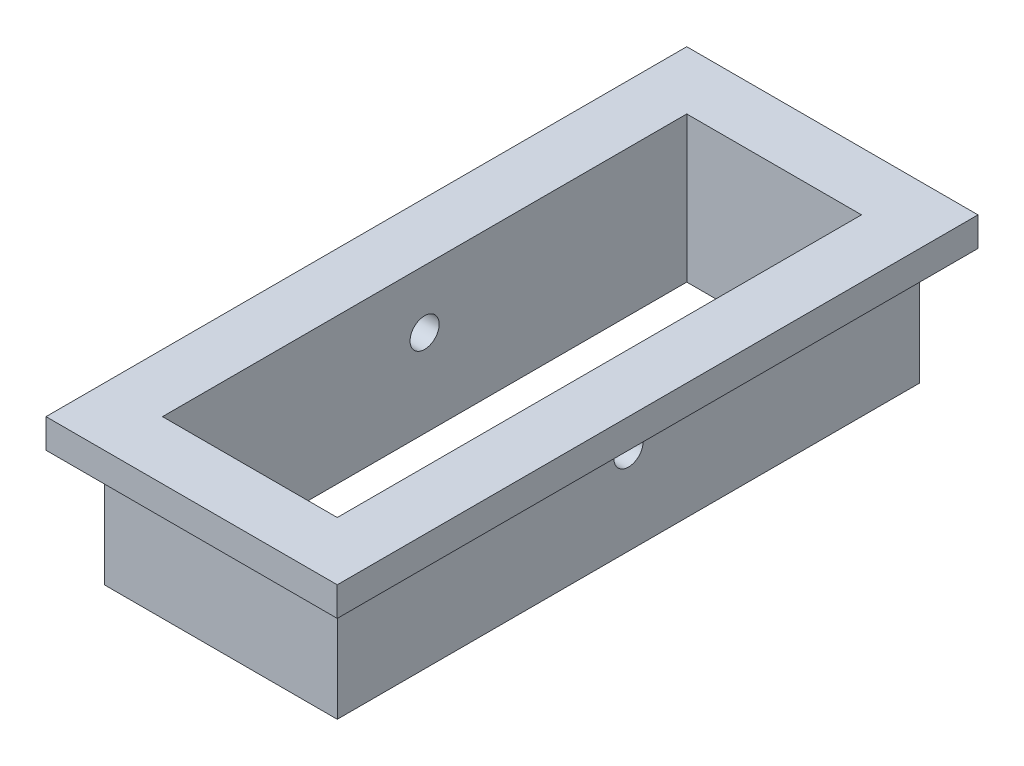
ISO-10303-21;
HEADER;
FILE_DESCRIPTION(('STEP AP214'),'2;1');
FILE_NAME('part.step','',(''),(''),'','','');
FILE_SCHEMA(('AUTOMOTIVE_DESIGN { 1 0 10303 214 1 1 1 1 }'));
ENDSEC;
DATA;
#1=APPLICATION_CONTEXT('core data for automotive mechanical design processes');
#2=APPLICATION_PROTOCOL_DEFINITION('international standard','automotive_design',2000,#1);
#3=PRODUCT_CONTEXT('',#1,'mechanical');
#4=PRODUCT('Part','Part','',(#3));
#5=PRODUCT_RELATED_PRODUCT_CATEGORY('part','',(#4));
#6=PRODUCT_DEFINITION_FORMATION('','',#4);
#7=PRODUCT_DEFINITION_CONTEXT('part definition',#1,'design');
#8=PRODUCT_DEFINITION('design','',#6,#7);
#9=PRODUCT_DEFINITION_SHAPE('','',#8);
#10=(LENGTH_UNIT() NAMED_UNIT(*) SI_UNIT(.MILLI.,.METRE.));
#11=(NAMED_UNIT(*) PLANE_ANGLE_UNIT() SI_UNIT($,.RADIAN.));
#12=(NAMED_UNIT(*) SI_UNIT($,.STERADIAN.) SOLID_ANGLE_UNIT());
#13=UNCERTAINTY_MEASURE_WITH_UNIT(LENGTH_MEASURE(1.E-05),#10,'distance_accuracy_value','');
#14=(GEOMETRIC_REPRESENTATION_CONTEXT(3) GLOBAL_UNCERTAINTY_ASSIGNED_CONTEXT((#13)) GLOBAL_UNIT_ASSIGNED_CONTEXT((#10,
#11,#12)) REPRESENTATION_CONTEXT('',''));
#15=CARTESIAN_POINT('',(0.,0.,0.));
#16=DIRECTION('',(0.,0.,1.));
#17=DIRECTION('',(1.,0.,0.));
#18=AXIS2_PLACEMENT_3D('',#15,#16,#17);
#19=CARTESIAN_POINT('',(-5.08,6.35,12.7));
#20=DIRECTION('',(1.,0.,0.));
#21=DIRECTION('',(0.,0.,-1.));
#22=AXIS2_PLACEMENT_3D('',#19,#20,#21);
#23=PLANE('',#22);
#24=CARTESIAN_POINT('',(-5.08,3.81,0.));
#25=DIRECTION('',(1.,0.,0.));
#26=DIRECTION('',(0.,0.,-1.));
#27=AXIS2_PLACEMENT_3D('',#24,#25,#26);
#28=CIRCLE('',#27,0.635);
#29=CARTESIAN_POINT('',(-5.08,3.81,-0.635));
#30=VERTEX_POINT('',#29);
#31=EDGE_CURVE('E228',#30,#30,#28,.T.);
#32=ORIENTED_EDGE('',*,*,#31,.T.);
#33=EDGE_LOOP('',(#32));
#34=FACE_BOUND('',#33,.T.);
#35=DIRECTION('',(0.,0.,1.));
#36=VECTOR('',#35,1.);
#37=CARTESIAN_POINT('',(-5.08,5.08,-12.7));
#38=LINE('',#37,#36);
#39=CARTESIAN_POINT('',(-5.08,5.08,-12.7));
#40=VERTEX_POINT('',#39);
#41=CARTESIAN_POINT('',(-5.08,5.08,12.7));
#42=VERTEX_POINT('',#41);
#43=EDGE_CURVE('E230',#40,#42,#38,.T.);
#44=ORIENTED_EDGE('',*,*,#43,.F.);
#45=DIRECTION('',(0.,-1.,0.));
#46=VECTOR('',#45,1.);
#47=CARTESIAN_POINT('',(-5.08,6.35,-12.7));
#48=LINE('',#47,#46);
#49=CARTESIAN_POINT('',(-5.08,0.,-12.7));
#50=VERTEX_POINT('',#49);
#51=EDGE_CURVE('E208',#40,#50,#48,.T.);
#52=ORIENTED_EDGE('',*,*,#51,.T.);
#53=DIRECTION('',(0.,0.,1.));
#54=VECTOR('',#53,1.);
#55=CARTESIAN_POINT('',(-5.08,0.,12.7));
#56=LINE('',#55,#54);
#57=CARTESIAN_POINT('',(-5.08,0.,12.7));
#58=VERTEX_POINT('',#57);
#59=EDGE_CURVE('E196',#50,#58,#56,.T.);
#60=ORIENTED_EDGE('',*,*,#59,.T.);
#61=DIRECTION('',(0.,-1.,0.));
#62=VECTOR('',#61,1.);
#63=CARTESIAN_POINT('',(-5.08,6.35,12.7));
#64=LINE('',#63,#62);
#65=EDGE_CURVE('E11',#42,#58,#64,.T.);
#66=ORIENTED_EDGE('',*,*,#65,.F.);
#67=EDGE_LOOP('',(#44,#52,#60,#66));
#68=FACE_BOUND('',#67,.T.);
#69=ADVANCED_FACE('F32',(#34,#68),#23,.F.);
#70=CARTESIAN_POINT('',(5.08,6.35,12.7));
#71=DIRECTION('',(0.,0.,-1.));
#72=DIRECTION('',(-1.,0.,0.));
#73=AXIS2_PLACEMENT_3D('',#70,#71,#72);
#74=PLANE('',#73);
#75=DIRECTION('',(1.,0.,0.));
#76=VECTOR('',#75,1.);
#77=CARTESIAN_POINT('',(-5.08,5.08,12.7));
#78=LINE('',#77,#76);
#79=CARTESIAN_POINT('',(5.08,5.08,12.7));
#80=VERTEX_POINT('',#79);
#81=EDGE_CURVE('E46',#42,#80,#78,.T.);
#82=ORIENTED_EDGE('',*,*,#81,.F.);
#83=ORIENTED_EDGE('',*,*,#65,.T.);
#84=DIRECTION('',(1.,0.,0.));
#85=VECTOR('',#84,1.);
#86=CARTESIAN_POINT('',(5.08,0.,12.7));
#87=LINE('',#86,#85);
#88=CARTESIAN_POINT('',(5.08,0.,12.7));
#89=VERTEX_POINT('',#88);
#90=EDGE_CURVE('E199',#58,#89,#87,.T.);
#91=ORIENTED_EDGE('',*,*,#90,.T.);
#92=DIRECTION('',(0.,-1.,0.));
#93=VECTOR('',#92,1.);
#94=CARTESIAN_POINT('',(5.08,6.35,12.7));
#95=LINE('',#94,#93);
#96=EDGE_CURVE('E40',#80,#89,#95,.T.);
#97=ORIENTED_EDGE('',*,*,#96,.F.);
#98=EDGE_LOOP('',(#82,#83,#91,#97));
#99=FACE_BOUND('',#98,.T.);
#100=ADVANCED_FACE('F216',(#99),#74,.F.);
#101=CARTESIAN_POINT('',(5.08,6.35,12.7));
#102=DIRECTION('',(-1.,0.,0.));
#103=DIRECTION('',(0.,0.,1.));
#104=AXIS2_PLACEMENT_3D('',#101,#102,#103);
#105=PLANE('',#104);
#106=CARTESIAN_POINT('',(5.08,3.81,0.));
#107=DIRECTION('',(-1.,0.,0.));
#108=DIRECTION('',(0.,0.,1.));
#109=AXIS2_PLACEMENT_3D('',#106,#107,#108);
#110=CIRCLE('',#109,0.635);
#111=CARTESIAN_POINT('',(5.08,3.81,0.635));
#112=VERTEX_POINT('',#111);
#113=EDGE_CURVE('E233',#112,#112,#110,.T.);
#114=ORIENTED_EDGE('',*,*,#113,.T.);
#115=EDGE_LOOP('',(#114));
#116=FACE_BOUND('',#115,.T.);
#117=DIRECTION('',(0.,0.,-1.));
#118=VECTOR('',#117,1.);
#119=CARTESIAN_POINT('',(5.08,5.08,12.7));
#120=LINE('',#119,#118);
#121=CARTESIAN_POINT('',(5.08,5.08,-12.7));
#122=VERTEX_POINT('',#121);
#123=EDGE_CURVE('E54',#80,#122,#120,.T.);
#124=ORIENTED_EDGE('',*,*,#123,.F.);
#125=ORIENTED_EDGE('',*,*,#96,.T.);
#126=DIRECTION('',(0.,0.,-1.));
#127=VECTOR('',#126,1.);
#128=CARTESIAN_POINT('',(5.08,0.,12.7));
#129=LINE('',#128,#127);
#130=CARTESIAN_POINT('',(5.08,0.,-12.7));
#131=VERTEX_POINT('',#130);
#132=EDGE_CURVE('E202',#89,#131,#129,.T.);
#133=ORIENTED_EDGE('',*,*,#132,.T.);
#134=DIRECTION('',(0.,-1.,0.));
#135=VECTOR('',#134,1.);
#136=CARTESIAN_POINT('',(5.08,6.35,-12.7));
#137=LINE('',#136,#135);
#138=EDGE_CURVE('E210',#122,#131,#137,.T.);
#139=ORIENTED_EDGE('',*,*,#138,.F.);
#140=EDGE_LOOP('',(#124,#125,#133,#139));
#141=FACE_BOUND('',#140,.T.);
#142=ADVANCED_FACE('F212',(#116,#141),#105,.F.);
#143=CARTESIAN_POINT('',(5.08,6.35,-12.7));
#144=DIRECTION('',(0.,0.,1.));
#145=DIRECTION('',(1.,0.,0.));
#146=AXIS2_PLACEMENT_3D('',#143,#144,#145);
#147=PLANE('',#146);
#148=DIRECTION('',(-1.,0.,0.));
#149=VECTOR('',#148,1.);
#150=CARTESIAN_POINT('',(5.08,5.08,-12.7));
#151=LINE('',#150,#149);
#152=EDGE_CURVE('E225',#122,#40,#151,.T.);
#153=ORIENTED_EDGE('',*,*,#152,.F.);
#154=ORIENTED_EDGE('',*,*,#138,.T.);
#155=DIRECTION('',(-1.,0.,0.));
#156=VECTOR('',#155,1.);
#157=CARTESIAN_POINT('',(5.08,0.,-12.7));
#158=LINE('',#157,#156);
#159=EDGE_CURVE('E205',#131,#50,#158,.T.);
#160=ORIENTED_EDGE('',*,*,#159,.T.);
#161=ORIENTED_EDGE('',*,*,#51,.F.);
#162=EDGE_LOOP('',(#153,#154,#160,#161));
#163=FACE_BOUND('',#162,.T.);
#164=ADVANCED_FACE('F222',(#163),#147,.F.);
#165=CARTESIAN_POINT('',(0.,6.35,0.));
#166=DIRECTION('',(0.,1.,0.));
#167=DIRECTION('',(0.,0.,1.));
#168=AXIS2_PLACEMENT_3D('',#165,#166,#167);
#169=PLANE('',#168);
#170=DIRECTION('',(-1.,0.,0.));
#171=VECTOR('',#170,1.);
#172=CARTESIAN_POINT('',(3.81,6.35,-11.43));
#173=LINE('',#172,#171);
#174=CARTESIAN_POINT('',(3.81,6.35,-11.43));
#175=VERTEX_POINT('',#174);
#176=CARTESIAN_POINT('',(-3.81,6.35,-11.43));
#177=VERTEX_POINT('',#176);
#178=EDGE_CURVE('E168',#175,#177,#173,.T.);
#179=ORIENTED_EDGE('',*,*,#178,.F.);
#180=DIRECTION('',(0.,0.,-1.));
#181=VECTOR('',#180,1.);
#182=CARTESIAN_POINT('',(3.81,6.35,11.43));
#183=LINE('',#182,#181);
#184=CARTESIAN_POINT('',(3.81,6.35,11.43));
#185=VERTEX_POINT('',#184);
#186=EDGE_CURVE('E166',#185,#175,#183,.T.);
#187=ORIENTED_EDGE('',*,*,#186,.F.);
#188=DIRECTION('',(1.,0.,0.));
#189=VECTOR('',#188,1.);
#190=CARTESIAN_POINT('',(3.81,6.35,11.43));
#191=LINE('',#190,#189);
#192=CARTESIAN_POINT('',(-3.81,6.35,11.43));
#193=VERTEX_POINT('',#192);
#194=EDGE_CURVE('E174',#193,#185,#191,.T.);
#195=ORIENTED_EDGE('',*,*,#194,.F.);
#196=DIRECTION('',(0.,0.,1.));
#197=VECTOR('',#196,1.);
#198=CARTESIAN_POINT('',(-3.81,6.35,11.43));
#199=LINE('',#198,#197);
#200=EDGE_CURVE('E171',#177,#193,#199,.T.);
#201=ORIENTED_EDGE('',*,*,#200,.F.);
#202=EDGE_LOOP('',(#179,#187,#195,#201));
#203=FACE_BOUND('',#202,.T.);
#204=DIRECTION('',(-1.,0.,0.));
#205=VECTOR('',#204,1.);
#206=CARTESIAN_POINT('',(6.35,6.35,-13.97));
#207=LINE('',#206,#205);
#208=CARTESIAN_POINT('',(6.35,6.35,-13.97));
#209=VERTEX_POINT('',#208);
#210=CARTESIAN_POINT('',(-6.35,6.35,-13.97));
#211=VERTEX_POINT('',#210);
#212=EDGE_CURVE('E156',#209,#211,#207,.T.);
#213=ORIENTED_EDGE('',*,*,#212,.T.);
#214=DIRECTION('',(0.,0.,1.));
#215=VECTOR('',#214,1.);
#216=CARTESIAN_POINT('',(-6.35,6.35,-13.97));
#217=LINE('',#216,#215);
#218=CARTESIAN_POINT('',(-6.35,6.35,13.97));
#219=VERTEX_POINT('',#218);
#220=EDGE_CURVE('E126',#211,#219,#217,.T.);
#221=ORIENTED_EDGE('',*,*,#220,.T.);
#222=DIRECTION('',(1.,0.,0.));
#223=VECTOR('',#222,1.);
#224=CARTESIAN_POINT('',(-6.35,6.35,13.97));
#225=LINE('',#224,#223);
#226=CARTESIAN_POINT('',(6.35,6.35,13.97));
#227=VERTEX_POINT('',#226);
#228=EDGE_CURVE('E149',#219,#227,#225,.T.);
#229=ORIENTED_EDGE('',*,*,#228,.T.);
#230=DIRECTION('',(0.,0.,-1.));
#231=VECTOR('',#230,1.);
#232=CARTESIAN_POINT('',(6.35,6.35,13.97));
#233=LINE('',#232,#231);
#234=EDGE_CURVE('E146',#227,#209,#233,.T.);
#235=ORIENTED_EDGE('',*,*,#234,.T.);
#236=EDGE_LOOP('',(#213,#221,#229,#235));
#237=FACE_BOUND('',#236,.T.);
#238=ADVANCED_FACE('F285',(#203,#237),#169,.T.);
#239=CARTESIAN_POINT('',(0.,0.,0.));
#240=DIRECTION('',(0.,1.,0.));
#241=DIRECTION('',(0.,0.,1.));
#242=AXIS2_PLACEMENT_3D('',#239,#240,#241);
#243=PLANE('',#242);
#244=ORIENTED_EDGE('',*,*,#59,.F.);
#245=ORIENTED_EDGE('',*,*,#159,.F.);
#246=ORIENTED_EDGE('',*,*,#132,.F.);
#247=ORIENTED_EDGE('',*,*,#90,.F.);
#248=EDGE_LOOP('',(#244,#245,#246,#247));
#249=FACE_BOUND('',#248,.T.);
#250=DIRECTION('',(0.,0.,-1.));
#251=VECTOR('',#250,1.);
#252=CARTESIAN_POINT('',(3.81,0.,11.43));
#253=LINE('',#252,#251);
#254=CARTESIAN_POINT('',(3.81,0.,11.43));
#255=VERTEX_POINT('',#254);
#256=CARTESIAN_POINT('',(3.81,0.,-11.43));
#257=VERTEX_POINT('',#256);
#258=EDGE_CURVE('E162',#255,#257,#253,.T.);
#259=ORIENTED_EDGE('',*,*,#258,.T.);
#260=DIRECTION('',(-1.,0.,0.));
#261=VECTOR('',#260,1.);
#262=CARTESIAN_POINT('',(3.81,0.,-11.43));
#263=LINE('',#262,#261);
#264=CARTESIAN_POINT('',(-3.81,0.,-11.43));
#265=VERTEX_POINT('',#264);
#266=EDGE_CURVE('E179',#257,#265,#263,.T.);
#267=ORIENTED_EDGE('',*,*,#266,.T.);
#268=DIRECTION('',(0.,0.,1.));
#269=VECTOR('',#268,1.);
#270=CARTESIAN_POINT('',(-3.81,0.,11.43));
#271=LINE('',#270,#269);
#272=CARTESIAN_POINT('',(-3.81,0.,11.43));
#273=VERTEX_POINT('',#272);
#274=EDGE_CURVE('E182',#265,#273,#271,.T.);
#275=ORIENTED_EDGE('',*,*,#274,.T.);
#276=DIRECTION('',(1.,0.,0.));
#277=VECTOR('',#276,1.);
#278=CARTESIAN_POINT('',(3.81,0.,11.43));
#279=LINE('',#278,#277);
#280=EDGE_CURVE('E169',#273,#255,#279,.T.);
#281=ORIENTED_EDGE('',*,*,#280,.T.);
#282=EDGE_LOOP('',(#259,#267,#275,#281));
#283=FACE_BOUND('',#282,.T.);
#284=ADVANCED_FACE('F219',(#249,#283),#243,.F.);
#285=CARTESIAN_POINT('',(3.81,6.35,11.43));
#286=DIRECTION('',(-1.,0.,0.));
#287=DIRECTION('',(0.,0.,1.));
#288=AXIS2_PLACEMENT_3D('',#285,#286,#287);
#289=PLANE('',#288);
#290=CARTESIAN_POINT('',(3.81,3.81,0.));
#291=DIRECTION('',(-1.,0.,0.));
#292=DIRECTION('',(0.,0.,1.));
#293=AXIS2_PLACEMENT_3D('',#290,#291,#292);
#294=CIRCLE('',#293,0.635);
#295=CARTESIAN_POINT('',(3.81,3.81,0.635));
#296=VERTEX_POINT('',#295);
#297=EDGE_CURVE('E300',#296,#296,#294,.T.);
#298=ORIENTED_EDGE('',*,*,#297,.F.);
#299=EDGE_LOOP('',(#298));
#300=FACE_BOUND('',#299,.T.);
#301=ORIENTED_EDGE('',*,*,#258,.F.);
#302=DIRECTION('',(0.,-1.,0.));
#303=VECTOR('',#302,1.);
#304=CARTESIAN_POINT('',(3.81,6.35,11.43));
#305=LINE('',#304,#303);
#306=EDGE_CURVE('E176',#185,#255,#305,.T.);
#307=ORIENTED_EDGE('',*,*,#306,.F.);
#308=ORIENTED_EDGE('',*,*,#186,.T.);
#309=DIRECTION('',(0.,-1.,0.));
#310=VECTOR('',#309,1.);
#311=CARTESIAN_POINT('',(3.81,6.35,-11.43));
#312=LINE('',#311,#310);
#313=EDGE_CURVE('E193',#175,#257,#312,.T.);
#314=ORIENTED_EDGE('',*,*,#313,.T.);
#315=EDGE_LOOP('',(#301,#307,#308,#314));
#316=FACE_BOUND('',#315,.T.);
#317=ADVANCED_FACE('F280',(#300,#316),#289,.T.);
#318=CARTESIAN_POINT('',(3.81,6.35,-11.43));
#319=DIRECTION('',(0.,0.,1.));
#320=DIRECTION('',(1.,0.,0.));
#321=AXIS2_PLACEMENT_3D('',#318,#319,#320);
#322=PLANE('',#321);
#323=ORIENTED_EDGE('',*,*,#266,.F.);
#324=ORIENTED_EDGE('',*,*,#313,.F.);
#325=ORIENTED_EDGE('',*,*,#178,.T.);
#326=DIRECTION('',(0.,-1.,0.));
#327=VECTOR('',#326,1.);
#328=CARTESIAN_POINT('',(-3.81,6.35,-11.43));
#329=LINE('',#328,#327);
#330=EDGE_CURVE('E191',#177,#265,#329,.T.);
#331=ORIENTED_EDGE('',*,*,#330,.T.);
#332=EDGE_LOOP('',(#323,#324,#325,#331));
#333=FACE_BOUND('',#332,.T.);
#334=ADVANCED_FACE('F276',(#333),#322,.T.);
#335=CARTESIAN_POINT('',(-3.81,6.35,11.43));
#336=DIRECTION('',(1.,0.,0.));
#337=DIRECTION('',(0.,0.,-1.));
#338=AXIS2_PLACEMENT_3D('',#335,#336,#337);
#339=PLANE('',#338);
#340=CARTESIAN_POINT('',(-3.81,3.81,0.));
#341=DIRECTION('',(1.,0.,0.));
#342=DIRECTION('',(0.,0.,-1.));
#343=AXIS2_PLACEMENT_3D('',#340,#341,#342);
#344=CIRCLE('',#343,0.635);
#345=CARTESIAN_POINT('',(-3.81,3.81,-0.635));
#346=VERTEX_POINT('',#345);
#347=EDGE_CURVE('E35',#346,#346,#344,.T.);
#348=ORIENTED_EDGE('',*,*,#347,.F.);
#349=EDGE_LOOP('',(#348));
#350=FACE_BOUND('',#349,.T.);
#351=ORIENTED_EDGE('',*,*,#274,.F.);
#352=ORIENTED_EDGE('',*,*,#330,.F.);
#353=ORIENTED_EDGE('',*,*,#200,.T.);
#354=DIRECTION('',(0.,-1.,0.));
#355=VECTOR('',#354,1.);
#356=CARTESIAN_POINT('',(-3.81,6.35,11.43));
#357=LINE('',#356,#355);
#358=EDGE_CURVE('E189',#193,#273,#357,.T.);
#359=ORIENTED_EDGE('',*,*,#358,.T.);
#360=EDGE_LOOP('',(#351,#352,#353,#359));
#361=FACE_BOUND('',#360,.T.);
#362=ADVANCED_FACE('F272',(#350,#361),#339,.T.);
#363=CARTESIAN_POINT('',(3.81,6.35,11.43));
#364=DIRECTION('',(0.,0.,-1.));
#365=DIRECTION('',(-1.,0.,0.));
#366=AXIS2_PLACEMENT_3D('',#363,#364,#365);
#367=PLANE('',#366);
#368=ORIENTED_EDGE('',*,*,#280,.F.);
#369=ORIENTED_EDGE('',*,*,#358,.F.);
#370=ORIENTED_EDGE('',*,*,#194,.T.);
#371=ORIENTED_EDGE('',*,*,#306,.T.);
#372=EDGE_LOOP('',(#368,#369,#370,#371));
#373=FACE_BOUND('',#372,.T.);
#374=ADVANCED_FACE('F269',(#373),#367,.T.);
#375=CARTESIAN_POINT('',(6.35,5.08,-13.97));
#376=DIRECTION('',(0.,0.,-1.));
#377=DIRECTION('',(-1.,0.,0.));
#378=AXIS2_PLACEMENT_3D('',#375,#376,#377);
#379=PLANE('',#378);
#380=ORIENTED_EDGE('',*,*,#212,.F.);
#381=DIRECTION('',(0.,1.,0.));
#382=VECTOR('',#381,1.);
#383=CARTESIAN_POINT('',(6.35,5.08,-13.97));
#384=LINE('',#383,#382);
#385=CARTESIAN_POINT('',(6.35,5.08,-13.97));
#386=VERTEX_POINT('',#385);
#387=EDGE_CURVE('E145',#386,#209,#384,.T.);
#388=ORIENTED_EDGE('',*,*,#387,.F.);
#389=DIRECTION('',(-1.,0.,0.));
#390=VECTOR('',#389,1.);
#391=CARTESIAN_POINT('',(6.35,5.08,-13.97));
#392=LINE('',#391,#390);
#393=CARTESIAN_POINT('',(-6.35,5.08,-13.97));
#394=VERTEX_POINT('',#393);
#395=EDGE_CURVE('E139',#386,#394,#392,.T.);
#396=ORIENTED_EDGE('',*,*,#395,.T.);
#397=DIRECTION('',(0.,1.,0.));
#398=VECTOR('',#397,1.);
#399=CARTESIAN_POINT('',(-6.35,5.08,-13.97));
#400=LINE('',#399,#398);
#401=EDGE_CURVE('E121',#394,#211,#400,.T.);
#402=ORIENTED_EDGE('',*,*,#401,.T.);
#403=EDGE_LOOP('',(#380,#388,#396,#402));
#404=FACE_BOUND('',#403,.T.);
#405=ADVANCED_FACE('F144',(#404),#379,.T.);
#406=CARTESIAN_POINT('',(6.35,5.08,13.97));
#407=DIRECTION('',(1.,0.,0.));
#408=DIRECTION('',(0.,0.,-1.));
#409=AXIS2_PLACEMENT_3D('',#406,#407,#408);
#410=PLANE('',#409);
#411=ORIENTED_EDGE('',*,*,#234,.F.);
#412=DIRECTION('',(0.,1.,0.));
#413=VECTOR('',#412,1.);
#414=CARTESIAN_POINT('',(6.35,5.08,13.97));
#415=LINE('',#414,#413);
#416=CARTESIAN_POINT('',(6.35,5.08,13.97));
#417=VERTEX_POINT('',#416);
#418=EDGE_CURVE('E163',#417,#227,#415,.T.);
#419=ORIENTED_EDGE('',*,*,#418,.F.);
#420=DIRECTION('',(0.,0.,-1.));
#421=VECTOR('',#420,1.);
#422=CARTESIAN_POINT('',(6.35,5.08,13.97));
#423=LINE('',#422,#421);
#424=EDGE_CURVE('E132',#417,#386,#423,.T.);
#425=ORIENTED_EDGE('',*,*,#424,.T.);
#426=ORIENTED_EDGE('',*,*,#387,.T.);
#427=EDGE_LOOP('',(#411,#419,#425,#426));
#428=FACE_BOUND('',#427,.T.);
#429=ADVANCED_FACE('F257',(#428),#410,.T.);
#430=CARTESIAN_POINT('',(-6.35,5.08,13.97));
#431=DIRECTION('',(0.,0.,1.));
#432=DIRECTION('',(1.,0.,0.));
#433=AXIS2_PLACEMENT_3D('',#430,#431,#432);
#434=PLANE('',#433);
#435=ORIENTED_EDGE('',*,*,#228,.F.);
#436=DIRECTION('',(0.,1.,0.));
#437=VECTOR('',#436,1.);
#438=CARTESIAN_POINT('',(-6.35,5.08,13.97));
#439=LINE('',#438,#437);
#440=CARTESIAN_POINT('',(-6.35,5.08,13.97));
#441=VERTEX_POINT('',#440);
#442=EDGE_CURVE('E131',#441,#219,#439,.T.);
#443=ORIENTED_EDGE('',*,*,#442,.F.);
#444=DIRECTION('',(1.,0.,0.));
#445=VECTOR('',#444,1.);
#446=CARTESIAN_POINT('',(-6.35,5.08,13.97));
#447=LINE('',#446,#445);
#448=EDGE_CURVE('E142',#441,#417,#447,.T.);
#449=ORIENTED_EDGE('',*,*,#448,.T.);
#450=ORIENTED_EDGE('',*,*,#418,.T.);
#451=EDGE_LOOP('',(#435,#443,#449,#450));
#452=FACE_BOUND('',#451,.T.);
#453=ADVANCED_FACE('F260',(#452),#434,.T.);
#454=CARTESIAN_POINT('',(-6.35,5.08,-13.97));
#455=DIRECTION('',(-1.,0.,0.));
#456=DIRECTION('',(0.,0.,1.));
#457=AXIS2_PLACEMENT_3D('',#454,#455,#456);
#458=PLANE('',#457);
#459=ORIENTED_EDGE('',*,*,#220,.F.);
#460=ORIENTED_EDGE('',*,*,#401,.F.);
#461=DIRECTION('',(0.,0.,1.));
#462=VECTOR('',#461,1.);
#463=CARTESIAN_POINT('',(-6.35,5.08,-13.97));
#464=LINE('',#463,#462);
#465=EDGE_CURVE('E124',#394,#441,#464,.T.);
#466=ORIENTED_EDGE('',*,*,#465,.T.);
#467=ORIENTED_EDGE('',*,*,#442,.T.);
#468=EDGE_LOOP('',(#459,#460,#466,#467));
#469=FACE_BOUND('',#468,.T.);
#470=ADVANCED_FACE('F123',(#469),#458,.T.);
#471=CARTESIAN_POINT('',(0.,5.08,0.));
#472=DIRECTION('',(0.,1.,0.));
#473=DIRECTION('',(0.,0.,1.));
#474=AXIS2_PLACEMENT_3D('',#471,#472,#473);
#475=PLANE('',#474);
#476=ORIENTED_EDGE('',*,*,#81,.T.);
#477=ORIENTED_EDGE('',*,*,#123,.T.);
#478=ORIENTED_EDGE('',*,*,#152,.T.);
#479=ORIENTED_EDGE('',*,*,#43,.T.);
#480=EDGE_LOOP('',(#476,#477,#478,#479));
#481=FACE_BOUND('',#480,.T.);
#482=ORIENTED_EDGE('',*,*,#395,.F.);
#483=ORIENTED_EDGE('',*,*,#424,.F.);
#484=ORIENTED_EDGE('',*,*,#448,.F.);
#485=ORIENTED_EDGE('',*,*,#465,.F.);
#486=EDGE_LOOP('',(#482,#483,#484,#485));
#487=FACE_BOUND('',#486,.T.);
#488=ADVANCED_FACE('F137',(#481,#487),#475,.F.);
#489=CARTESIAN_POINT('',(6.35,3.81,0.));
#490=DIRECTION('',(-1.,0.,0.));
#491=DIRECTION('',(0.,0.,1.));
#492=AXIS2_PLACEMENT_3D('',#489,#490,#491);
#493=CYLINDRICAL_SURFACE('',#492,0.635);
#494=ORIENTED_EDGE('',*,*,#347,.T.);
#495=EDGE_LOOP('',(#494));
#496=FACE_BOUND('',#495,.T.);
#497=ORIENTED_EDGE('',*,*,#31,.F.);
#498=EDGE_LOOP('',(#497));
#499=FACE_BOUND('',#498,.T.);
#500=ADVANCED_FACE('F244',(#496,#499),#493,.F.);
#501=ORIENTED_EDGE('',*,*,#297,.T.);
#502=EDGE_LOOP('',(#501));
#503=FACE_BOUND('',#502,.T.);
#504=ORIENTED_EDGE('',*,*,#113,.F.);
#505=EDGE_LOOP('',(#504));
#506=FACE_BOUND('',#505,.T.);
#507=ADVANCED_FACE('F246',(#503,#506),#493,.F.);
#508=CLOSED_SHELL('',(#69,#100,#142,#164,#238,#284,#317,#334,#362,#374,#405,#429,#453,#470,#488,
#500,#507));
#509=MANIFOLD_SOLID_BREP('B2',#508);
#510=ADVANCED_BREP_SHAPE_REPRESENTATION('',(#18,#509),#14);
#511=SHAPE_DEFINITION_REPRESENTATION(#9,#510);
ENDSEC;
END-ISO-10303-21;
